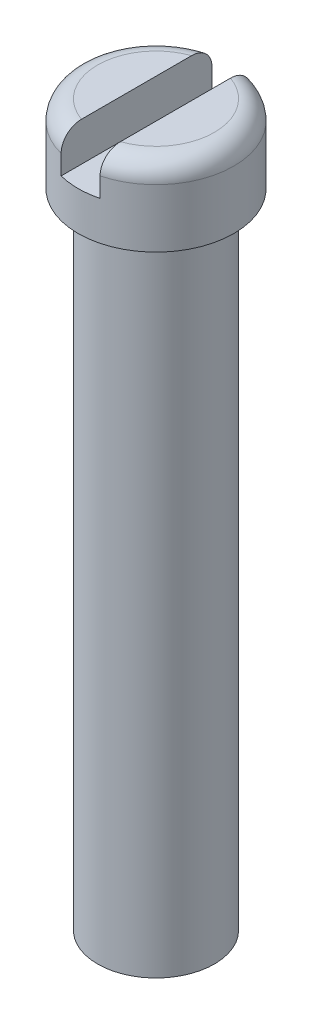
ISO-10303-21;
HEADER;
FILE_DESCRIPTION(('STEP AP214'),'2;1');
FILE_NAME('part.step','',(''),(''),'','','');
FILE_SCHEMA(('AUTOMOTIVE_DESIGN { 1 0 10303 214 1 1 1 1 }'));
ENDSEC;
DATA;
#1=APPLICATION_CONTEXT('core data for automotive mechanical design processes');
#2=APPLICATION_PROTOCOL_DEFINITION('international standard','automotive_design',2000,#1);
#3=PRODUCT_CONTEXT('',#1,'mechanical');
#4=PRODUCT('Part','Part','',(#3));
#5=PRODUCT_RELATED_PRODUCT_CATEGORY('part','',(#4));
#6=PRODUCT_DEFINITION_FORMATION('','',#4);
#7=PRODUCT_DEFINITION_CONTEXT('part definition',#1,'design');
#8=PRODUCT_DEFINITION('design','',#6,#7);
#9=PRODUCT_DEFINITION_SHAPE('','',#8);
#10=(LENGTH_UNIT() NAMED_UNIT(*) SI_UNIT(.MILLI.,.METRE.));
#11=(NAMED_UNIT(*) PLANE_ANGLE_UNIT() SI_UNIT($,.RADIAN.));
#12=(NAMED_UNIT(*) SI_UNIT($,.STERADIAN.) SOLID_ANGLE_UNIT());
#13=UNCERTAINTY_MEASURE_WITH_UNIT(LENGTH_MEASURE(1.E-05),#10,'distance_accuracy_value','');
#14=(GEOMETRIC_REPRESENTATION_CONTEXT(3) GLOBAL_UNCERTAINTY_ASSIGNED_CONTEXT((#13)) GLOBAL_UNIT_ASSIGNED_CONTEXT((#10,
#11,#12)) REPRESENTATION_CONTEXT('',''));
#15=CARTESIAN_POINT('',(0.,0.,0.));
#16=DIRECTION('',(0.,0.,1.));
#17=DIRECTION('',(1.,0.,0.));
#18=AXIS2_PLACEMENT_3D('',#15,#16,#17);
#19=CARTESIAN_POINT('',(0.,18.5,0.));
#20=DIRECTION('',(0.,1.,0.));
#21=DIRECTION('',(0.,0.,1.));
#22=AXIS2_PLACEMENT_3D('',#19,#20,#21);
#23=PLANE('',#22);
#24=DIRECTION('',(0.,0.,1.));
#25=VECTOR('',#24,1.);
#26=CARTESIAN_POINT('',(-0.5,18.5,0.));
#27=LINE('',#26,#25);
#28=CARTESIAN_POINT('',(-0.5,18.5,-1.41421356237309));
#29=VERTEX_POINT('',#28);
#30=CARTESIAN_POINT('',(-0.5,18.5,1.41421356237309));
#31=VERTEX_POINT('',#30);
#32=EDGE_CURVE('E115',#29,#31,#27,.T.);
#33=ORIENTED_EDGE('',*,*,#32,.F.);
#34=CARTESIAN_POINT('',(0.,18.5,0.));
#35=DIRECTION('',(0.,1.,0.));
#36=DIRECTION('',(0.,0.,1.));
#37=AXIS2_PLACEMENT_3D('',#34,#35,#36);
#38=CIRCLE('',#37,1.5);
#39=EDGE_CURVE('E171',#29,#31,#38,.T.);
#40=ORIENTED_EDGE('',*,*,#39,.T.);
#41=EDGE_LOOP('',(#33,#40));
#42=FACE_BOUND('',#41,.T.);
#43=ADVANCED_FACE('F33',(#42),#23,.T.);
#44=CARTESIAN_POINT('',(0.,16.5,0.));
#45=DIRECTION('',(0.,-1.,0.));
#46=DIRECTION('',(0.,0.,-1.));
#47=AXIS2_PLACEMENT_3D('',#44,#45,#46);
#48=CYLINDRICAL_SURFACE('',#47,1.5);
#49=CARTESIAN_POINT('',(0.,16.5,0.));
#50=DIRECTION('',(0.,1.,0.));
#51=DIRECTION('',(0.,0.,1.));
#52=AXIS2_PLACEMENT_3D('',#49,#50,#51);
#53=CIRCLE('',#52,1.5);
#54=CARTESIAN_POINT('',(0.,16.5,1.5));
#55=VERTEX_POINT('',#54);
#56=EDGE_CURVE('E131',#55,#55,#53,.T.);
#57=ORIENTED_EDGE('',*,*,#56,.F.);
#58=EDGE_LOOP('',(#57));
#59=FACE_BOUND('',#58,.T.);
#60=CARTESIAN_POINT('',(0.,0.,0.));
#61=DIRECTION('',(0.,1.,0.));
#62=DIRECTION('',(0.,0.,1.));
#63=AXIS2_PLACEMENT_3D('',#60,#61,#62);
#64=CIRCLE('',#63,1.5);
#65=CARTESIAN_POINT('',(0.,0.,1.5));
#66=VERTEX_POINT('',#65);
#67=EDGE_CURVE('E130',#66,#66,#64,.T.);
#68=ORIENTED_EDGE('',*,*,#67,.T.);
#69=EDGE_LOOP('',(#68));
#70=FACE_BOUND('',#69,.T.);
#71=ADVANCED_FACE('F186',(#59,#70),#48,.T.);
#72=CARTESIAN_POINT('',(0.,0.,0.));
#73=DIRECTION('',(0.,1.,0.));
#74=DIRECTION('',(0.,0.,1.));
#75=AXIS2_PLACEMENT_3D('',#72,#73,#74);
#76=PLANE('',#75);
#77=ORIENTED_EDGE('',*,*,#67,.F.);
#78=EDGE_LOOP('',(#77));
#79=FACE_BOUND('',#78,.T.);
#80=ADVANCED_FACE('F193',(#79),#76,.F.);
#81=CARTESIAN_POINT('',(0.,16.5,0.));
#82=DIRECTION('',(0.,1.,0.));
#83=DIRECTION('',(0.,0.,1.));
#84=AXIS2_PLACEMENT_3D('',#81,#82,#83);
#85=PLANE('',#84);
#86=CARTESIAN_POINT('',(0.,16.5,0.));
#87=DIRECTION('',(0.,1.,0.));
#88=DIRECTION('',(0.,0.,1.));
#89=AXIS2_PLACEMENT_3D('',#86,#87,#88);
#90=CIRCLE('',#89,2.);
#91=CARTESIAN_POINT('',(0.,16.5,2.));
#92=VERTEX_POINT('',#91);
#93=EDGE_CURVE('E127',#92,#92,#90,.T.);
#94=ORIENTED_EDGE('',*,*,#93,.F.);
#95=EDGE_LOOP('',(#94));
#96=FACE_BOUND('',#95,.T.);
#97=ORIENTED_EDGE('',*,*,#56,.T.);
#98=EDGE_LOOP('',(#97));
#99=FACE_BOUND('',#98,.T.);
#100=ADVANCED_FACE('F183',(#96,#99),#85,.F.);
#101=CARTESIAN_POINT('',(0.,18.5,0.));
#102=DIRECTION('',(0.,-1.,0.));
#103=DIRECTION('',(0.,0.,-1.));
#104=AXIS2_PLACEMENT_3D('',#101,#102,#103);
#105=CYLINDRICAL_SURFACE('',#104,2.);
#106=DIRECTION('',(0.,-1.,0.));
#107=VECTOR('',#106,1.);
#108=CARTESIAN_POINT('',(0.5,18.5,-1.93649167310371));
#109=LINE('',#108,#107);
#110=CARTESIAN_POINT('',(0.5,17.5,-1.93649167310371));
#111=VERTEX_POINT('',#110);
#112=CARTESIAN_POINT('',(0.5,18.,-1.93649167310371));
#113=VERTEX_POINT('',#112);
#114=EDGE_CURVE('E104',#111,#113,#109,.F.);
#115=ORIENTED_EDGE('',*,*,#114,.T.);
#116=CARTESIAN_POINT('',(0.,18.,0.));
#117=DIRECTION('',(0.,1.,0.));
#118=DIRECTION('',(0.,0.,1.));
#119=AXIS2_PLACEMENT_3D('',#116,#117,#118);
#120=CIRCLE('',#119,2.);
#121=CARTESIAN_POINT('',(0.5,18.,1.93649167310371));
#122=VERTEX_POINT('',#121);
#123=EDGE_CURVE('E99',#113,#122,#120,.F.);
#124=ORIENTED_EDGE('',*,*,#123,.T.);
#125=DIRECTION('',(0.,-1.,0.));
#126=VECTOR('',#125,1.);
#127=CARTESIAN_POINT('',(0.5,18.5,1.93649167310371));
#128=LINE('',#127,#126);
#129=CARTESIAN_POINT('',(0.5,17.5,1.93649167310371));
#130=VERTEX_POINT('',#129);
#131=EDGE_CURVE('E91',#122,#130,#128,.T.);
#132=ORIENTED_EDGE('',*,*,#131,.T.);
#133=CARTESIAN_POINT('',(0.,17.5,0.));
#134=DIRECTION('',(0.,1.,0.));
#135=DIRECTION('',(0.,0.,1.));
#136=AXIS2_PLACEMENT_3D('',#133,#134,#135);
#137=CIRCLE('',#136,2.);
#138=CARTESIAN_POINT('',(-0.5,17.5,1.93649167310371));
#139=VERTEX_POINT('',#138);
#140=EDGE_CURVE('E97',#139,#130,#137,.T.);
#141=ORIENTED_EDGE('',*,*,#140,.F.);
#142=DIRECTION('',(0.,-1.,0.));
#143=VECTOR('',#142,1.);
#144=CARTESIAN_POINT('',(-0.5,18.5,1.93649167310371));
#145=LINE('',#144,#143);
#146=CARTESIAN_POINT('',(-0.5,18.,1.93649167310371));
#147=VERTEX_POINT('',#146);
#148=EDGE_CURVE('E103',#139,#147,#145,.F.);
#149=ORIENTED_EDGE('',*,*,#148,.T.);
#150=CARTESIAN_POINT('',(0.,18.,0.));
#151=DIRECTION('',(0.,1.,0.));
#152=DIRECTION('',(0.,0.,1.));
#153=AXIS2_PLACEMENT_3D('',#150,#151,#152);
#154=CIRCLE('',#153,2.);
#155=CARTESIAN_POINT('',(-0.5,18.,-1.93649167310371));
#156=VERTEX_POINT('',#155);
#157=EDGE_CURVE('E173',#147,#156,#154,.F.);
#158=ORIENTED_EDGE('',*,*,#157,.T.);
#159=DIRECTION('',(0.,-1.,0.));
#160=VECTOR('',#159,1.);
#161=CARTESIAN_POINT('',(-0.5,18.5,-1.93649167310371));
#162=LINE('',#161,#160);
#163=CARTESIAN_POINT('',(-0.5,17.5,-1.93649167310371));
#164=VERTEX_POINT('',#163);
#165=EDGE_CURVE('E125',#156,#164,#162,.T.);
#166=ORIENTED_EDGE('',*,*,#165,.T.);
#167=EDGE_CURVE('E114',#111,#164,#137,.T.);
#168=ORIENTED_EDGE('',*,*,#167,.F.);
#169=EDGE_LOOP('',(#115,#124,#132,#141,#149,#158,#166,#168));
#170=FACE_BOUND('',#169,.T.);
#171=ORIENTED_EDGE('',*,*,#93,.T.);
#172=EDGE_LOOP('',(#171));
#173=FACE_BOUND('',#172,.T.);
#174=ADVANCED_FACE('F94',(#170,#173),#105,.T.);
#175=DIRECTION('',(0.,0.,-1.));
#176=VECTOR('',#175,1.);
#177=CARTESIAN_POINT('',(0.5,18.5,0.));
#178=LINE('',#177,#176);
#179=CARTESIAN_POINT('',(0.5,18.5,1.41421356237309));
#180=VERTEX_POINT('',#179);
#181=CARTESIAN_POINT('',(0.5,18.5,-1.41421356237309));
#182=VERTEX_POINT('',#181);
#183=EDGE_CURVE('E134',#180,#182,#178,.T.);
#184=ORIENTED_EDGE('',*,*,#183,.F.);
#185=CARTESIAN_POINT('',(0.,18.5,0.));
#186=DIRECTION('',(0.,1.,0.));
#187=DIRECTION('',(0.,0.,1.));
#188=AXIS2_PLACEMENT_3D('',#185,#186,#187);
#189=CIRCLE('',#188,1.5);
#190=EDGE_CURVE('E139',#180,#182,#189,.T.);
#191=ORIENTED_EDGE('',*,*,#190,.T.);
#192=EDGE_LOOP('',(#184,#191));
#193=FACE_BOUND('',#192,.T.);
#194=ADVANCED_FACE('F164',(#193),#23,.T.);
#195=CARTESIAN_POINT('',(0.,17.5,0.));
#196=DIRECTION('',(0.,1.,0.));
#197=DIRECTION('',(0.,0.,1.));
#198=AXIS2_PLACEMENT_3D('',#195,#196,#197);
#199=PLANE('',#198);
#200=DIRECTION('',(0.,0.,-1.));
#201=VECTOR('',#200,1.);
#202=CARTESIAN_POINT('',(0.5,17.5,-2.));
#203=LINE('',#202,#201);
#204=EDGE_CURVE('E111',#130,#111,#203,.T.);
#205=ORIENTED_EDGE('',*,*,#204,.T.);
#206=ORIENTED_EDGE('',*,*,#167,.T.);
#207=DIRECTION('',(0.,0.,1.));
#208=VECTOR('',#207,1.);
#209=CARTESIAN_POINT('',(-0.5,17.5,-2.));
#210=LINE('',#209,#208);
#211=EDGE_CURVE('E113',#164,#139,#210,.T.);
#212=ORIENTED_EDGE('',*,*,#211,.T.);
#213=ORIENTED_EDGE('',*,*,#140,.T.);
#214=EDGE_LOOP('',(#205,#206,#212,#213));
#215=FACE_BOUND('',#214,.T.);
#216=ADVANCED_FACE('F109',(#215),#199,.T.);
#217=CARTESIAN_POINT('',(-0.5,17.5,-2.));
#218=DIRECTION('',(-1.,0.,0.));
#219=DIRECTION('',(0.,0.,1.));
#220=AXIS2_PLACEMENT_3D('',#217,#218,#219);
#221=PLANE('',#220);
#222=ORIENTED_EDGE('',*,*,#32,.T.);
#223=CARTESIAN_POINT('',(-0.5,18.5,1.41421356237309));
#224=CARTESIAN_POINT('',(-0.5,18.5000247973866,1.44474957179467));
#225=CARTESIAN_POINT('',(-0.5,18.4975141783301,1.4753015016558));
#226=CARTESIAN_POINT('',(-0.5,18.4874728044803,1.53560735423884));
#227=CARTESIAN_POINT('',(-0.5,18.4799355336563,1.56536018895175));
#228=CARTESIAN_POINT('',(-0.5,18.4598747927122,1.62320313650114));
#229=CARTESIAN_POINT('',(-0.5,18.4473428934878,1.65129034584513));
#230=CARTESIAN_POINT('',(-0.5,18.4175678561953,1.7048210246689));
#231=CARTESIAN_POINT('',(-0.5,18.4003290700546,1.73026690643827));
#232=CARTESIAN_POINT('',(-0.5,18.3623152921752,1.77676731064239));
#233=CARTESIAN_POINT('',(-0.5,18.3416995228856,1.7979519374634));
#234=CARTESIAN_POINT('',(-0.5,18.2970616026843,1.83638636380704));
#235=CARTESIAN_POINT('',(-0.5,18.2730388622233,1.85363548097065));
#236=CARTESIAN_POINT('',(-0.5,18.2233409263131,1.88297339618209));
#237=CARTESIAN_POINT('',(-0.5,18.1977722813855,1.89524312712855));
#238=CARTESIAN_POINT('',(-0.5,18.1449118247429,1.91517309368242));
#239=CARTESIAN_POINT('',(-0.5,18.1176219917995,1.9228385196369));
#240=CARTESIAN_POINT('',(-0.5,18.0750752668675,1.93087510992158));
#241=CARTESIAN_POINT('',(-0.5,18.060126328573,1.9329806802139));
#242=CARTESIAN_POINT('',(-0.5,18.0301207254008,1.93578810681624));
#243=CARTESIAN_POINT('',(-0.5,18.0150642645078,1.93649214373538));
#244=CARTESIAN_POINT('',(-0.5,18.0000000000001,1.93649167310437));
#245=B_SPLINE_CURVE_WITH_KNOTS('',3,(#223,#224,#225,#226,#227,#228,#229,#230,#231,#232,#233,
#234,#235,#236,#237,#238,#239,#240,#241,#242,#243,#244),.UNSPECIFIED.,.F.,.F.,(4,2,2,2,2,2,2,2,
2,2,4),(0.,0.0915293598956447,0.183177600195155,0.274981168581612,0.366700142321073,
0.454934668885179,0.543184482401645,0.627854716591973,0.712429323598743,0.757660730781091,
0.802821708425485),.UNSPECIFIED.);
#246=EDGE_CURVE('E11',#31,#147,#245,.T.);
#247=ORIENTED_EDGE('',*,*,#246,.T.);
#248=ORIENTED_EDGE('',*,*,#148,.F.);
#249=ORIENTED_EDGE('',*,*,#211,.F.);
#250=ORIENTED_EDGE('',*,*,#165,.F.);
#251=CARTESIAN_POINT('',(-0.5,18.,-1.93649167310371));
#252=CARTESIAN_POINT('',(-0.5,18.0274325368481,-1.93651830401817));
#253=CARTESIAN_POINT('',(-0.5,18.054853962425,-1.93416174886821));
#254=CARTESIAN_POINT('',(-0.5,18.1088716210915,-1.92488341349989));
#255=CARTESIAN_POINT('',(-0.5,18.1354690568059,-1.91796864994401));
#256=CARTESIAN_POINT('',(-0.5,18.1871308867821,-1.89977174477032));
#257=CARTESIAN_POINT('',(-0.5,18.212194912055,-1.88848855671541));
#258=CARTESIAN_POINT('',(-0.5,18.2601011606086,-1.86192158586809));
#259=CARTESIAN_POINT('',(-0.5,18.2829433077675,-1.84663766607597));
#260=CARTESIAN_POINT('',(-0.5,18.3260551314712,-1.81234441599383));
#261=CARTESIAN_POINT('',(-0.5,18.3462929619079,-1.7932950929329));
#262=CARTESIAN_POINT('',(-0.5,18.3833959779637,-1.7521568528644));
#263=CARTESIAN_POINT('',(-0.5,18.400260701943,-1.73006752050155));
#264=CARTESIAN_POINT('',(-0.5,18.4306966990358,-1.68278031537464));
#265=CARTESIAN_POINT('',(-0.5,18.4441534244843,-1.65750883292054));
#266=CARTESIAN_POINT('',(-0.5,18.4668286924189,-1.60512610045697));
#267=CARTESIAN_POINT('',(-0.5,18.4760462897014,-1.57801444168619));
#268=CARTESIAN_POINT('',(-0.5,18.4887276934545,-1.52811592022685));
#269=CARTESIAN_POINT('',(-0.5,18.4929644890633,-1.50552100807959));
#270=CARTESIAN_POINT('',(-0.5,18.4986008892018,-1.46002159660086));
#271=CARTESIAN_POINT('',(-0.5,18.5000057241892,-1.43711774680093));
#272=CARTESIAN_POINT('',(-0.5,18.5,-1.41421356237309));
#273=B_SPLINE_CURVE_WITH_KNOTS('',3,(#251,#252,#253,#254,#255,#256,#257,#258,#259,#260,#261,
#262,#263,#264,#265,#266,#267,#268,#269,#270,#271,#272),.UNSPECIFIED.,.F.,.F.,(4,2,2,2,2,2,2,2,
2,2,4),(0.,0.0821798835504245,0.164233558264882,0.246306900753853,0.328383054102516,
0.411382959184848,0.494394215791174,0.57990671537434,0.665438272547436,0.734231609526896,
0.802897772590917),.UNSPECIFIED.);
#274=EDGE_CURVE('E46',#156,#29,#273,.T.);
#275=ORIENTED_EDGE('',*,*,#274,.T.);
#276=EDGE_LOOP('',(#222,#247,#248,#249,#250,#275));
#277=FACE_BOUND('',#276,.T.);
#278=ADVANCED_FACE('F159',(#277),#221,.F.);
#279=CARTESIAN_POINT('',(0.5,17.5,-2.));
#280=DIRECTION('',(1.,0.,0.));
#281=DIRECTION('',(0.,0.,-1.));
#282=AXIS2_PLACEMENT_3D('',#279,#280,#281);
#283=PLANE('',#282);
#284=ORIENTED_EDGE('',*,*,#183,.T.);
#285=CARTESIAN_POINT('',(0.5,18.5,-1.41421356237309));
#286=CARTESIAN_POINT('',(0.5,18.5000247973866,-1.44474957179467));
#287=CARTESIAN_POINT('',(0.5,18.4975141783301,-1.4753015016558));
#288=CARTESIAN_POINT('',(0.5,18.4874728044803,-1.53560735423884));
#289=CARTESIAN_POINT('',(0.5,18.4799355336563,-1.56536018895175));
#290=CARTESIAN_POINT('',(0.5,18.4598747927122,-1.62320313650114));
#291=CARTESIAN_POINT('',(0.5,18.4473428934878,-1.65129034584513));
#292=CARTESIAN_POINT('',(0.5,18.4175678561953,-1.7048210246689));
#293=CARTESIAN_POINT('',(0.5,18.4003290700546,-1.73026690643827));
#294=CARTESIAN_POINT('',(0.5,18.3623152921752,-1.77676731064239));
#295=CARTESIAN_POINT('',(0.5,18.3416995228856,-1.7979519374634));
#296=CARTESIAN_POINT('',(0.5,18.2970616026843,-1.83638636380704));
#297=CARTESIAN_POINT('',(0.5,18.2730388622233,-1.85363548097065));
#298=CARTESIAN_POINT('',(0.5,18.2233409263131,-1.88297339618209));
#299=CARTESIAN_POINT('',(0.5,18.1977722813855,-1.89524312712855));
#300=CARTESIAN_POINT('',(0.5,18.1449118247429,-1.91517309368242));
#301=CARTESIAN_POINT('',(0.5,18.1176219917995,-1.9228385196369));
#302=CARTESIAN_POINT('',(0.5,18.0750752668675,-1.93087510992158));
#303=CARTESIAN_POINT('',(0.5,18.060126328573,-1.9329806802139));
#304=CARTESIAN_POINT('',(0.5,18.0301207254008,-1.93578810681624));
#305=CARTESIAN_POINT('',(0.5,18.0150642645078,-1.93649214373538));
#306=CARTESIAN_POINT('',(0.5,18.0000000000001,-1.93649167310437));
#307=B_SPLINE_CURVE_WITH_KNOTS('',3,(#285,#286,#287,#288,#289,#290,#291,#292,#293,#294,#295,
#296,#297,#298,#299,#300,#301,#302,#303,#304,#305,#306),.UNSPECIFIED.,.F.,.F.,(4,2,2,2,2,2,2,2,
2,2,4),(0.,0.0915293598956447,0.183177600195155,0.274981168581612,0.366700142321073,
0.454934668885179,0.543184482401645,0.627854716591973,0.712429323598743,0.757660730781091,
0.802821708425485),.UNSPECIFIED.);
#308=EDGE_CURVE('E148',#182,#113,#307,.T.);
#309=ORIENTED_EDGE('',*,*,#308,.T.);
#310=ORIENTED_EDGE('',*,*,#114,.F.);
#311=ORIENTED_EDGE('',*,*,#204,.F.);
#312=ORIENTED_EDGE('',*,*,#131,.F.);
#313=CARTESIAN_POINT('',(0.5,18.,1.93649167310371));
#314=CARTESIAN_POINT('',(0.5,18.0274325368481,1.93651830401817));
#315=CARTESIAN_POINT('',(0.5,18.054853962425,1.93416174886821));
#316=CARTESIAN_POINT('',(0.5,18.1088716210915,1.92488341349989));
#317=CARTESIAN_POINT('',(0.5,18.1354690568059,1.91796864994401));
#318=CARTESIAN_POINT('',(0.5,18.1871308867821,1.89977174477032));
#319=CARTESIAN_POINT('',(0.5,18.212194912055,1.88848855671541));
#320=CARTESIAN_POINT('',(0.5,18.2601011606086,1.86192158586809));
#321=CARTESIAN_POINT('',(0.5,18.2829433077675,1.84663766607597));
#322=CARTESIAN_POINT('',(0.5,18.3260551314712,1.81234441599383));
#323=CARTESIAN_POINT('',(0.5,18.3462929619079,1.7932950929329));
#324=CARTESIAN_POINT('',(0.5,18.3833959779637,1.7521568528644));
#325=CARTESIAN_POINT('',(0.5,18.400260701943,1.73006752050155));
#326=CARTESIAN_POINT('',(0.5,18.4306966990358,1.68278031537464));
#327=CARTESIAN_POINT('',(0.5,18.4441534244843,1.65750883292054));
#328=CARTESIAN_POINT('',(0.5,18.4668286924189,1.60512610045697));
#329=CARTESIAN_POINT('',(0.5,18.4760462897014,1.57801444168619));
#330=CARTESIAN_POINT('',(0.5,18.4887276934545,1.52811592022685));
#331=CARTESIAN_POINT('',(0.5,18.4929644890633,1.50552100807959));
#332=CARTESIAN_POINT('',(0.5,18.4986008892018,1.46002159660086));
#333=CARTESIAN_POINT('',(0.5,18.5000057241892,1.43711774680093));
#334=CARTESIAN_POINT('',(0.5,18.5,1.41421356237309));
#335=B_SPLINE_CURVE_WITH_KNOTS('',3,(#313,#314,#315,#316,#317,#318,#319,#320,#321,#322,#323,
#324,#325,#326,#327,#328,#329,#330,#331,#332,#333,#334),.UNSPECIFIED.,.F.,.F.,(4,2,2,2,2,2,2,2,
2,2,4),(0.,0.0821798835504245,0.164233558264882,0.246306900753853,0.328383054102516,
0.411382959184848,0.494394215791174,0.57990671537434,0.665438272547436,0.734231609526896,
0.802897772590917),.UNSPECIFIED.);
#336=EDGE_CURVE('E142',#122,#180,#335,.T.);
#337=ORIENTED_EDGE('',*,*,#336,.T.);
#338=EDGE_LOOP('',(#284,#309,#310,#311,#312,#337));
#339=FACE_BOUND('',#338,.T.);
#340=ADVANCED_FACE('F119',(#339),#283,.F.);
#341=CARTESIAN_POINT('',(0.,18.,0.));
#342=DIRECTION('',(0.,1.,0.));
#343=DIRECTION('',(0.,0.,1.));
#344=AXIS2_PLACEMENT_3D('',#341,#342,#343);
#345=TOROIDAL_SURFACE('',#344,1.5,0.5);
#346=ORIENTED_EDGE('',*,*,#336,.F.);
#347=ORIENTED_EDGE('',*,*,#123,.F.);
#348=ORIENTED_EDGE('',*,*,#308,.F.);
#349=ORIENTED_EDGE('',*,*,#190,.F.);
#350=EDGE_LOOP('',(#346,#347,#348,#349));
#351=FACE_BOUND('',#350,.T.);
#352=ADVANCED_FACE('F153',(#351),#345,.T.);
#353=CARTESIAN_POINT('',(0.,18.,0.));
#354=DIRECTION('',(0.,1.,0.));
#355=DIRECTION('',(0.,0.,1.));
#356=AXIS2_PLACEMENT_3D('',#353,#354,#355);
#357=TOROIDAL_SURFACE('',#356,1.5,0.5);
#358=ORIENTED_EDGE('',*,*,#274,.F.);
#359=ORIENTED_EDGE('',*,*,#157,.F.);
#360=ORIENTED_EDGE('',*,*,#246,.F.);
#361=ORIENTED_EDGE('',*,*,#39,.F.);
#362=EDGE_LOOP('',(#358,#359,#360,#361));
#363=FACE_BOUND('',#362,.T.);
#364=ADVANCED_FACE('F35',(#363),#357,.T.);
#365=CLOSED_SHELL('',(#43,#71,#80,#100,#174,#194,#216,#278,#340,#352,#364));
#366=MANIFOLD_SOLID_BREP('B2',#365);
#367=ADVANCED_BREP_SHAPE_REPRESENTATION('',(#18,#366),#14);
#368=SHAPE_DEFINITION_REPRESENTATION(#9,#367);
ENDSEC;
END-ISO-10303-21;
